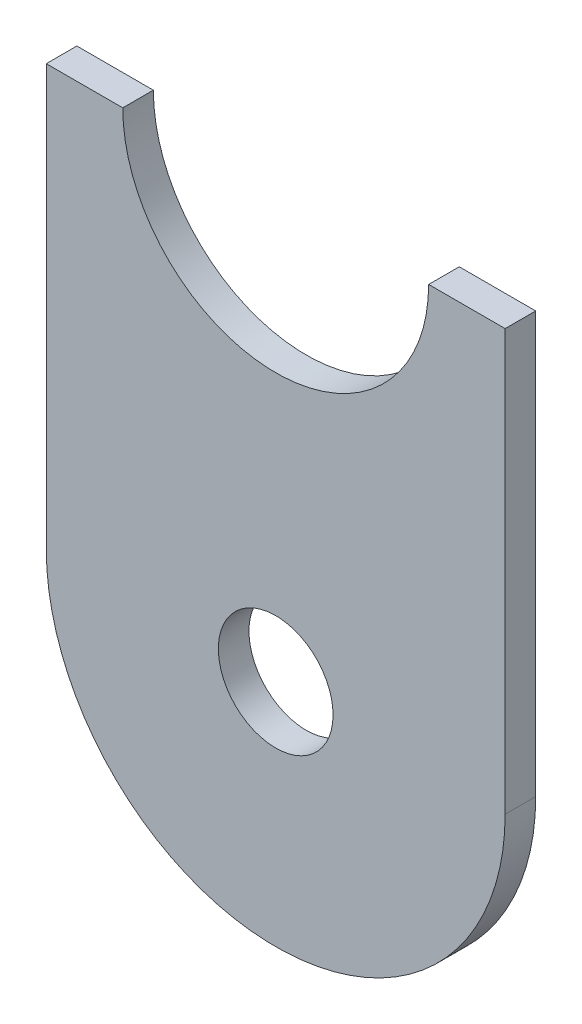
ISO-10303-21;
HEADER;
FILE_DESCRIPTION(('STEP AP214'),'2;1');
FILE_NAME('part.step','',(''),(''),'','','');
FILE_SCHEMA(('AUTOMOTIVE_DESIGN { 1 0 10303 214 1 1 1 1 }'));
ENDSEC;
DATA;
#1=APPLICATION_CONTEXT('core data for automotive mechanical design processes');
#2=APPLICATION_PROTOCOL_DEFINITION('international standard','automotive_design',2000,#1);
#3=PRODUCT_CONTEXT('',#1,'mechanical');
#4=PRODUCT('Part','Part','',(#3));
#5=PRODUCT_RELATED_PRODUCT_CATEGORY('part','',(#4));
#6=PRODUCT_DEFINITION_FORMATION('','',#4);
#7=PRODUCT_DEFINITION_CONTEXT('part definition',#1,'design');
#8=PRODUCT_DEFINITION('design','',#6,#7);
#9=PRODUCT_DEFINITION_SHAPE('','',#8);
#10=(LENGTH_UNIT() NAMED_UNIT(*) SI_UNIT(.MILLI.,.METRE.));
#11=(NAMED_UNIT(*) PLANE_ANGLE_UNIT() SI_UNIT($,.RADIAN.));
#12=(NAMED_UNIT(*) SI_UNIT($,.STERADIAN.) SOLID_ANGLE_UNIT());
#13=UNCERTAINTY_MEASURE_WITH_UNIT(LENGTH_MEASURE(1.E-05),#10,'distance_accuracy_value','');
#14=(GEOMETRIC_REPRESENTATION_CONTEXT(3) GLOBAL_UNCERTAINTY_ASSIGNED_CONTEXT((#13)) GLOBAL_UNIT_ASSIGNED_CONTEXT((#10,
#11,#12)) REPRESENTATION_CONTEXT('',''));
#15=CARTESIAN_POINT('',(0.,0.,0.));
#16=DIRECTION('',(0.,0.,1.));
#17=DIRECTION('',(1.,0.,0.));
#18=AXIS2_PLACEMENT_3D('',#15,#16,#17);
#19=CARTESIAN_POINT('',(0.,34.925,2.54));
#20=DIRECTION('',(0.,0.,-1.));
#21=DIRECTION('',(-1.,0.,0.));
#22=AXIS2_PLACEMENT_3D('',#19,#20,#21);
#23=CYLINDRICAL_SURFACE('',#22,12.7);
#24=CARTESIAN_POINT('',(0.,34.925,0.));
#25=DIRECTION('',(0.,0.,1.));
#26=DIRECTION('',(1.,0.,0.));
#27=AXIS2_PLACEMENT_3D('',#24,#25,#26);
#28=CIRCLE('',#27,12.7);
#29=CARTESIAN_POINT('',(-12.7,34.925,0.));
#30=VERTEX_POINT('',#29);
#31=CARTESIAN_POINT('',(12.7,34.925,0.));
#32=VERTEX_POINT('',#31);
#33=EDGE_CURVE('E122',#30,#32,#28,.T.);
#34=ORIENTED_EDGE('',*,*,#33,.F.);
#35=DIRECTION('',(0.,0.,-1.));
#36=VECTOR('',#35,1.);
#37=CARTESIAN_POINT('',(-12.7,34.925,2.54));
#38=LINE('',#37,#36);
#39=CARTESIAN_POINT('',(-12.7,34.925,2.54));
#40=VERTEX_POINT('',#39);
#41=EDGE_CURVE('E11',#40,#30,#38,.T.);
#42=ORIENTED_EDGE('',*,*,#41,.F.);
#43=CARTESIAN_POINT('',(0.,34.925,2.54));
#44=DIRECTION('',(0.,0.,1.));
#45=DIRECTION('',(1.,0.,0.));
#46=AXIS2_PLACEMENT_3D('',#43,#44,#45);
#47=CIRCLE('',#46,12.7);
#48=CARTESIAN_POINT('',(12.7,34.925,2.54));
#49=VERTEX_POINT('',#48);
#50=EDGE_CURVE('E137',#40,#49,#47,.T.);
#51=ORIENTED_EDGE('',*,*,#50,.T.);
#52=DIRECTION('',(0.,0.,-1.));
#53=VECTOR('',#52,1.);
#54=CARTESIAN_POINT('',(12.7,34.925,2.54));
#55=LINE('',#54,#53);
#56=EDGE_CURVE('E52',#49,#32,#55,.T.);
#57=ORIENTED_EDGE('',*,*,#56,.T.);
#58=EDGE_LOOP('',(#34,#42,#51,#57));
#59=FACE_BOUND('',#58,.T.);
#60=ADVANCED_FACE('F36',(#59),#23,.F.);
#61=CARTESIAN_POINT('',(0.,34.925,2.54));
#62=DIRECTION('',(0.,1.,0.));
#63=DIRECTION('',(0.,0.,1.));
#64=AXIS2_PLACEMENT_3D('',#61,#62,#63);
#65=PLANE('',#64);
#66=DIRECTION('',(1.,0.,0.));
#67=VECTOR('',#66,1.);
#68=CARTESIAN_POINT('',(0.,34.925,0.));
#69=LINE('',#68,#67);
#70=CARTESIAN_POINT('',(-19.05,34.925,0.));
#71=VERTEX_POINT('',#70);
#72=EDGE_CURVE('E124',#71,#30,#69,.T.);
#73=ORIENTED_EDGE('',*,*,#72,.F.);
#74=DIRECTION('',(0.,0.,-1.));
#75=VECTOR('',#74,1.);
#76=CARTESIAN_POINT('',(-19.05,34.925,2.54));
#77=LINE('',#76,#75);
#78=CARTESIAN_POINT('',(-19.05,34.925,2.54));
#79=VERTEX_POINT('',#78);
#80=EDGE_CURVE('E44',#79,#71,#77,.T.);
#81=ORIENTED_EDGE('',*,*,#80,.F.);
#82=DIRECTION('',(1.,0.,0.));
#83=VECTOR('',#82,1.);
#84=CARTESIAN_POINT('',(0.,34.925,2.54));
#85=LINE('',#84,#83);
#86=EDGE_CURVE('E117',#79,#40,#85,.T.);
#87=ORIENTED_EDGE('',*,*,#86,.T.);
#88=ORIENTED_EDGE('',*,*,#41,.T.);
#89=EDGE_LOOP('',(#73,#81,#87,#88));
#90=FACE_BOUND('',#89,.T.);
#91=ADVANCED_FACE('F146',(#90),#65,.T.);
#92=CARTESIAN_POINT('',(-19.05,0.,2.54));
#93=DIRECTION('',(-1.,0.,0.));
#94=DIRECTION('',(0.,0.,1.));
#95=AXIS2_PLACEMENT_3D('',#92,#93,#94);
#96=PLANE('',#95);
#97=DIRECTION('',(0.,1.,0.));
#98=VECTOR('',#97,1.);
#99=CARTESIAN_POINT('',(-19.05,0.,0.));
#100=LINE('',#99,#98);
#101=CARTESIAN_POINT('',(-19.05,0.,0.));
#102=VERTEX_POINT('',#101);
#103=EDGE_CURVE('E127',#102,#71,#100,.T.);
#104=ORIENTED_EDGE('',*,*,#103,.F.);
#105=DIRECTION('',(0.,0.,-1.));
#106=VECTOR('',#105,1.);
#107=CARTESIAN_POINT('',(-19.05,0.,2.54));
#108=LINE('',#107,#106);
#109=CARTESIAN_POINT('',(-19.05,0.,2.54));
#110=VERTEX_POINT('',#109);
#111=EDGE_CURVE('E110',#110,#102,#108,.T.);
#112=ORIENTED_EDGE('',*,*,#111,.F.);
#113=DIRECTION('',(0.,1.,0.));
#114=VECTOR('',#113,1.);
#115=CARTESIAN_POINT('',(-19.05,0.,2.54));
#116=LINE('',#115,#114);
#117=EDGE_CURVE('E100',#110,#79,#116,.T.);
#118=ORIENTED_EDGE('',*,*,#117,.T.);
#119=ORIENTED_EDGE('',*,*,#80,.T.);
#120=EDGE_LOOP('',(#104,#112,#118,#119));
#121=FACE_BOUND('',#120,.T.);
#122=ADVANCED_FACE('F143',(#121),#96,.T.);
#123=CARTESIAN_POINT('',(0.,0.,2.54));
#124=DIRECTION('',(0.,0.,-1.));
#125=DIRECTION('',(-1.,0.,0.));
#126=AXIS2_PLACEMENT_3D('',#123,#124,#125);
#127=CYLINDRICAL_SURFACE('',#126,19.05);
#128=CARTESIAN_POINT('',(0.,0.,0.));
#129=DIRECTION('',(0.,0.,1.));
#130=DIRECTION('',(1.,0.,0.));
#131=AXIS2_PLACEMENT_3D('',#128,#129,#130);
#132=CIRCLE('',#131,19.05);
#133=CARTESIAN_POINT('',(19.05,0.,0.));
#134=VERTEX_POINT('',#133);
#135=EDGE_CURVE('E107',#102,#134,#132,.T.);
#136=ORIENTED_EDGE('',*,*,#135,.T.);
#137=DIRECTION('',(0.,0.,-1.));
#138=VECTOR('',#137,1.);
#139=CARTESIAN_POINT('',(19.05,0.,2.54));
#140=LINE('',#139,#138);
#141=CARTESIAN_POINT('',(19.05,0.,2.54));
#142=VERTEX_POINT('',#141);
#143=EDGE_CURVE('E104',#142,#134,#140,.T.);
#144=ORIENTED_EDGE('',*,*,#143,.F.);
#145=CARTESIAN_POINT('',(0.,0.,2.54));
#146=DIRECTION('',(0.,0.,1.));
#147=DIRECTION('',(1.,0.,0.));
#148=AXIS2_PLACEMENT_3D('',#145,#146,#147);
#149=CIRCLE('',#148,19.05);
#150=EDGE_CURVE('E91',#110,#142,#149,.T.);
#151=ORIENTED_EDGE('',*,*,#150,.F.);
#152=ORIENTED_EDGE('',*,*,#111,.T.);
#153=EDGE_LOOP('',(#136,#144,#151,#152));
#154=FACE_BOUND('',#153,.T.);
#155=ADVANCED_FACE('F105',(#154),#127,.T.);
#156=CARTESIAN_POINT('',(19.05,0.,2.54));
#157=DIRECTION('',(-1.,0.,0.));
#158=DIRECTION('',(0.,0.,1.));
#159=AXIS2_PLACEMENT_3D('',#156,#157,#158);
#160=PLANE('',#159);
#161=DIRECTION('',(0.,1.,0.));
#162=VECTOR('',#161,1.);
#163=CARTESIAN_POINT('',(19.05,0.,0.));
#164=LINE('',#163,#162);
#165=CARTESIAN_POINT('',(19.05,34.925,0.));
#166=VERTEX_POINT('',#165);
#167=EDGE_CURVE('E132',#134,#166,#164,.T.);
#168=ORIENTED_EDGE('',*,*,#167,.T.);
#169=DIRECTION('',(0.,0.,-1.));
#170=VECTOR('',#169,1.);
#171=CARTESIAN_POINT('',(19.05,34.925,2.54));
#172=LINE('',#171,#170);
#173=CARTESIAN_POINT('',(19.05,34.925,2.54));
#174=VERTEX_POINT('',#173);
#175=EDGE_CURVE('E72',#174,#166,#172,.T.);
#176=ORIENTED_EDGE('',*,*,#175,.F.);
#177=DIRECTION('',(0.,1.,0.));
#178=VECTOR('',#177,1.);
#179=CARTESIAN_POINT('',(19.05,0.,2.54));
#180=LINE('',#179,#178);
#181=EDGE_CURVE('E97',#142,#174,#180,.T.);
#182=ORIENTED_EDGE('',*,*,#181,.F.);
#183=ORIENTED_EDGE('',*,*,#143,.T.);
#184=EDGE_LOOP('',(#168,#176,#182,#183));
#185=FACE_BOUND('',#184,.T.);
#186=ADVANCED_FACE('F112',(#185),#160,.F.);
#187=EDGE_CURVE('E128',#32,#166,#69,.T.);
#188=ORIENTED_EDGE('',*,*,#187,.F.);
#189=ORIENTED_EDGE('',*,*,#56,.F.);
#190=EDGE_CURVE('E113',#49,#174,#85,.T.);
#191=ORIENTED_EDGE('',*,*,#190,.T.);
#192=ORIENTED_EDGE('',*,*,#175,.T.);
#193=EDGE_LOOP('',(#188,#189,#191,#192));
#194=FACE_BOUND('',#193,.T.);
#195=ADVANCED_FACE('F151',(#194),#65,.T.);
#196=CARTESIAN_POINT('',(0.,0.,2.54));
#197=DIRECTION('',(0.,0.,-1.));
#198=DIRECTION('',(-1.,0.,0.));
#199=AXIS2_PLACEMENT_3D('',#196,#197,#198);
#200=CYLINDRICAL_SURFACE('',#199,4.7625);
#201=CARTESIAN_POINT('',(0.,0.,2.54));
#202=DIRECTION('',(0.,0.,1.));
#203=DIRECTION('',(1.,0.,0.));
#204=AXIS2_PLACEMENT_3D('',#201,#202,#203);
#205=CIRCLE('',#204,4.7625);
#206=CARTESIAN_POINT('',(4.7625,0.,2.54));
#207=VERTEX_POINT('',#206);
#208=EDGE_CURVE('E115',#207,#207,#205,.T.);
#209=ORIENTED_EDGE('',*,*,#208,.T.);
#210=EDGE_LOOP('',(#209));
#211=FACE_BOUND('',#210,.T.);
#212=CARTESIAN_POINT('',(0.,0.,0.));
#213=DIRECTION('',(0.,0.,1.));
#214=DIRECTION('',(1.,0.,0.));
#215=AXIS2_PLACEMENT_3D('',#212,#213,#214);
#216=CIRCLE('',#215,4.7625);
#217=CARTESIAN_POINT('',(4.7625,0.,0.));
#218=VERTEX_POINT('',#217);
#219=EDGE_CURVE('E134',#218,#218,#216,.T.);
#220=ORIENTED_EDGE('',*,*,#219,.F.);
#221=EDGE_LOOP('',(#220));
#222=FACE_BOUND('',#221,.T.);
#223=ADVANCED_FACE('F153',(#211,#222),#200,.F.);
#224=CARTESIAN_POINT('',(0.,0.,2.54));
#225=DIRECTION('',(0.,0.,1.));
#226=DIRECTION('',(1.,0.,0.));
#227=AXIS2_PLACEMENT_3D('',#224,#225,#226);
#228=PLANE('',#227);
#229=ORIENTED_EDGE('',*,*,#50,.F.);
#230=ORIENTED_EDGE('',*,*,#86,.F.);
#231=ORIENTED_EDGE('',*,*,#117,.F.);
#232=ORIENTED_EDGE('',*,*,#150,.T.);
#233=ORIENTED_EDGE('',*,*,#181,.T.);
#234=ORIENTED_EDGE('',*,*,#190,.F.);
#235=EDGE_LOOP('',(#229,#230,#231,#232,#233,#234));
#236=FACE_BOUND('',#235,.T.);
#237=ORIENTED_EDGE('',*,*,#208,.F.);
#238=EDGE_LOOP('',(#237));
#239=FACE_BOUND('',#238,.T.);
#240=ADVANCED_FACE('F93',(#236,#239),#228,.T.);
#241=CARTESIAN_POINT('',(0.,0.,0.));
#242=DIRECTION('',(0.,0.,1.));
#243=DIRECTION('',(1.,0.,0.));
#244=AXIS2_PLACEMENT_3D('',#241,#242,#243);
#245=PLANE('',#244);
#246=ORIENTED_EDGE('',*,*,#33,.T.);
#247=ORIENTED_EDGE('',*,*,#187,.T.);
#248=ORIENTED_EDGE('',*,*,#167,.F.);
#249=ORIENTED_EDGE('',*,*,#135,.F.);
#250=ORIENTED_EDGE('',*,*,#103,.T.);
#251=ORIENTED_EDGE('',*,*,#72,.T.);
#252=EDGE_LOOP('',(#246,#247,#248,#249,#250,#251));
#253=FACE_BOUND('',#252,.T.);
#254=ORIENTED_EDGE('',*,*,#219,.T.);
#255=EDGE_LOOP('',(#254));
#256=FACE_BOUND('',#255,.T.);
#257=ADVANCED_FACE('F148',(#253,#256),#245,.F.);
#258=CLOSED_SHELL('',(#60,#91,#122,#155,#186,#195,#223,#240,#257));
#259=MANIFOLD_SOLID_BREP('B2',#258);
#260=ADVANCED_BREP_SHAPE_REPRESENTATION('',(#18,#259),#14);
#261=SHAPE_DEFINITION_REPRESENTATION(#9,#260);
ENDSEC;
END-ISO-10303-21;
